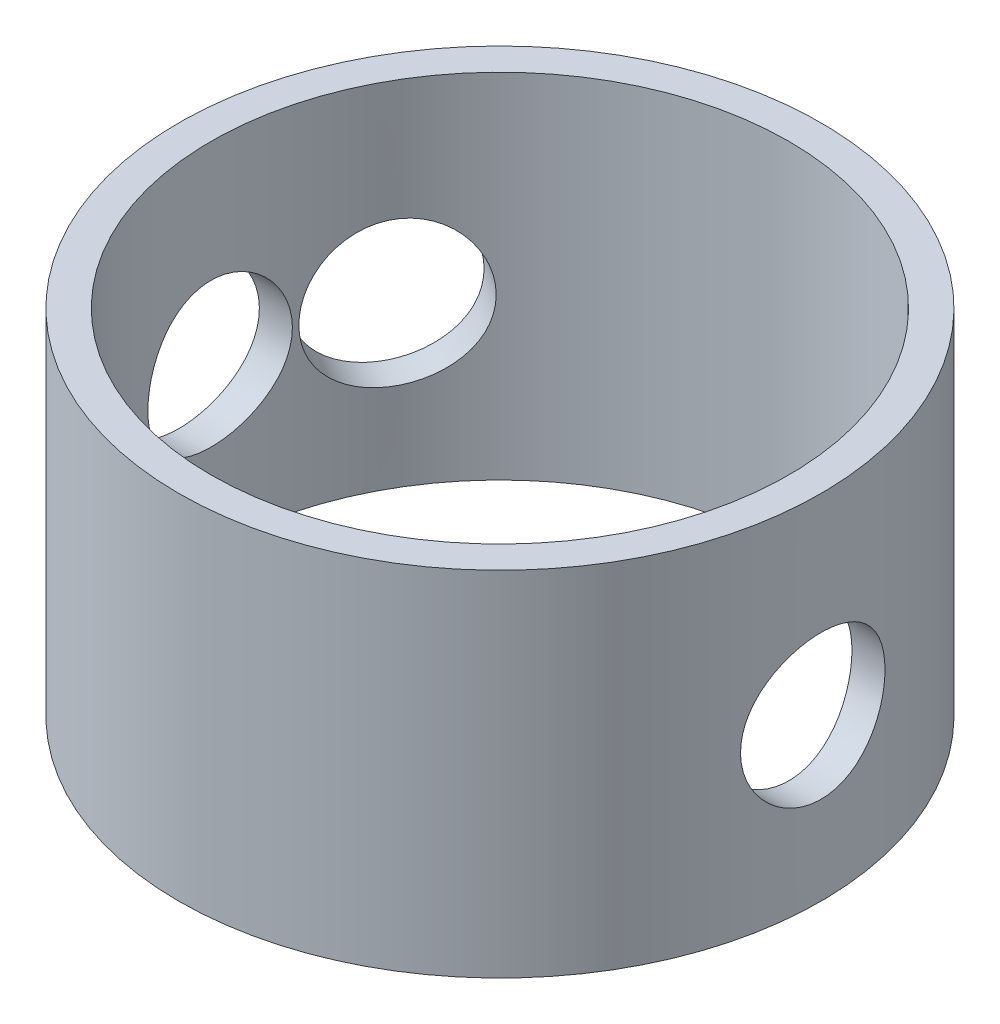
ISO-10303-21;
HEADER;
FILE_DESCRIPTION(('STEP AP214'),'2;1');
FILE_NAME('part.step','',(''),(''),'','','');
FILE_SCHEMA(('AUTOMOTIVE_DESIGN { 1 0 10303 214 1 1 1 1 }'));
ENDSEC;
DATA;
#1=APPLICATION_CONTEXT('core data for automotive mechanical design processes');
#2=APPLICATION_PROTOCOL_DEFINITION('international standard','automotive_design',2000,#1);
#3=PRODUCT_CONTEXT('',#1,'mechanical');
#4=PRODUCT('Part','Part','',(#3));
#5=PRODUCT_RELATED_PRODUCT_CATEGORY('part','',(#4));
#6=PRODUCT_DEFINITION_FORMATION('','',#4);
#7=PRODUCT_DEFINITION_CONTEXT('part definition',#1,'design');
#8=PRODUCT_DEFINITION('design','',#6,#7);
#9=PRODUCT_DEFINITION_SHAPE('','',#8);
#10=(LENGTH_UNIT() NAMED_UNIT(*) SI_UNIT(.MILLI.,.METRE.));
#11=(NAMED_UNIT(*) PLANE_ANGLE_UNIT() SI_UNIT($,.RADIAN.));
#12=(NAMED_UNIT(*) SI_UNIT($,.STERADIAN.) SOLID_ANGLE_UNIT());
#13=UNCERTAINTY_MEASURE_WITH_UNIT(LENGTH_MEASURE(1.E-05),#10,'distance_accuracy_value','');
#14=(GEOMETRIC_REPRESENTATION_CONTEXT(3) GLOBAL_UNCERTAINTY_ASSIGNED_CONTEXT((#13)) GLOBAL_UNIT_ASSIGNED_CONTEXT((#10,
#11,#12)) REPRESENTATION_CONTEXT('',''));
#15=CARTESIAN_POINT('',(0.,0.,0.));
#16=DIRECTION('',(0.,0.,1.));
#17=DIRECTION('',(1.,0.,0.));
#18=AXIS2_PLACEMENT_3D('',#15,#16,#17);
#19=CARTESIAN_POINT('',(0.,-5.,0.));
#20=DIRECTION('',(0.,1.,0.));
#21=DIRECTION('',(0.,0.,1.));
#22=AXIS2_PLACEMENT_3D('',#19,#20,#21);
#23=CYLINDRICAL_SURFACE('',#22,10.);
#24=CARTESIAN_POINT('',(-10.,2.25,0.));
#25=CARTESIAN_POINT('',(-9.99999771694518,2.24999587078108,-0.124699980173304));
#26=CARTESIAN_POINT('',(-9.99764387141181,2.2395982953768,-0.249449090211301));
#27=CARTESIAN_POINT('',(-9.9884813966466,2.19832951041739,-0.495397749746435));
#28=CARTESIAN_POINT('',(-9.9816697099651,2.16744424900414,-0.616594803385697));
#29=CARTESIAN_POINT('',(-9.96434919694451,2.08622125907406,-0.851849872654528));
#30=CARTESIAN_POINT('',(-9.95384434542968,2.0359044383554,-0.965915408843231));
#31=CARTESIAN_POINT('',(-9.93026839001207,1.91731441158288,-1.18398243160764));
#32=CARTESIAN_POINT('',(-9.91719732262225,1.84904146101007,-1.28798406134451));
#33=CARTESIAN_POINT('',(-9.88967110046879,1.69525502679128,-1.48473408395884));
#34=CARTESIAN_POINT('',(-9.87519795610526,1.60949570009561,-1.57728781649952));
#35=CARTESIAN_POINT('',(-9.8466241340422,1.42369841608187,-1.74682611866484));
#36=CARTESIAN_POINT('',(-9.83252349122492,1.32365912711958,-1.82380923466833));
#37=CARTESIAN_POINT('',(-9.80611312139272,1.1106886380241,-1.96089062994942));
#38=CARTESIAN_POINT('',(-9.79382640798822,0.997619652513677,-2.0207796762197));
#39=CARTESIAN_POINT('',(-9.77269409851722,0.762699838887984,-2.12063014285829));
#40=CARTESIAN_POINT('',(-9.7638480651916,0.640850129006192,-2.16059409559087));
#41=CARTESIAN_POINT('',(-9.75078225790901,0.393945077725128,-2.2188126339931));
#42=CARTESIAN_POINT('',(-9.74648890346122,0.268975229377931,-2.237412923577));
#43=CARTESIAN_POINT('',(-9.74279372340889,0.0176207324970899,-2.25345144263654));
#44=CARTESIAN_POINT('',(-9.74339126020144,-0.108763729474717,-2.25089243055212));
#45=CARTESIAN_POINT('',(-9.7493438221449,-0.35677500839379,-2.22496273321229));
#46=CARTESIAN_POINT('',(-9.75460659824395,-0.478446565475752,-2.20199557166843));
#47=CARTESIAN_POINT('',(-9.76915058701734,-0.716164082748739,-2.13654167024627));
#48=CARTESIAN_POINT('',(-9.77843203686247,-0.832209710463741,-2.0940537783005));
#49=CARTESIAN_POINT('',(-9.80005729379312,-1.05650562440403,-1.99039912002163));
#50=CARTESIAN_POINT('',(-9.8124261019186,-1.16468246903344,-1.92907886854504));
#51=CARTESIAN_POINT('',(-9.83881732813755,-1.36935943001856,-1.78960795010145));
#52=CARTESIAN_POINT('',(-9.85283998387547,-1.46585786423543,-1.71145486305659));
#53=CARTESIAN_POINT('',(-9.88135331942439,-1.64676002262606,-1.53840941447694));
#54=CARTESIAN_POINT('',(-9.89584735926513,-1.73083578516287,-1.44317439868844));
#55=CARTESIAN_POINT('',(-9.92337817561626,-1.88187798698242,-1.23979023032877));
#56=CARTESIAN_POINT('',(-9.93641492265959,-1.94884408033572,-1.13164081671453));
#57=CARTESIAN_POINT('',(-9.9596085297879,-2.06385442564537,-0.905084686036906));
#58=CARTESIAN_POINT('',(-9.96975853624758,-2.11185375057136,-0.786654415509773));
#59=CARTESIAN_POINT('',(-9.98598436481004,-2.18717808536306,-0.543129505070469));
#60=CARTESIAN_POINT('',(-9.99206081464266,-2.21450628070668,-0.418035895178883));
#61=CARTESIAN_POINT('',(-9.99936485032445,-2.24723107008369,-0.167546638635216));
#62=CARTESIAN_POINT('',(-10.0006914083681,-2.25307538769192,-0.0422122904927544));
#63=CARTESIAN_POINT('',(-9.998624405112,-2.24388280727281,0.207642012862522));
#64=CARTESIAN_POINT('',(-9.99523118361733,-2.22884741250097,0.332162026055726));
#65=CARTESIAN_POINT('',(-9.98416853819685,-2.17869311915451,0.575355741580678));
#66=CARTESIAN_POINT('',(-9.97654952458062,-2.14381085342044,0.694080742417265));
#67=CARTESIAN_POINT('',(-9.95788891115751,-2.05521709888024,0.9239935007677));
#68=CARTESIAN_POINT('',(-9.94684700837049,-2.00150394318563,1.03518058999426));
#69=CARTESIAN_POINT('',(-9.92232244804704,-1.87585280628475,1.24869945121971));
#70=CARTESIAN_POINT('',(-9.90880573869581,-1.80365412939586,1.35087381002615));
#71=CARTESIAN_POINT('',(-9.8808971094203,-1.64342272060557,1.5418171847585));
#72=CARTESIAN_POINT('',(-9.86650506892447,-1.55538780407373,1.63058434803184));
#73=CARTESIAN_POINT('',(-9.83812317322868,-1.36392321097715,1.79397825629388));
#74=CARTESIAN_POINT('',(-9.82414670937266,-1.26022586804994,1.86829411913197));
#75=CARTESIAN_POINT('',(-9.79849887314339,-1.04156031811999,1.99845908651711));
#76=CARTESIAN_POINT('',(-9.78682739936824,-0.926592607260111,2.05430900349706));
#77=CARTESIAN_POINT('',(-9.76722644872885,-0.689273282785766,2.1455693288797));
#78=CARTESIAN_POINT('',(-9.75927557489345,-0.566968571315208,2.1810968796756));
#79=CARTESIAN_POINT('',(-9.74798028769131,-0.317921950371438,2.23104191763122));
#80=CARTESIAN_POINT('',(-9.74463508800211,-0.191180802116749,2.24546300830367));
#81=CARTESIAN_POINT('',(-9.74298148577602,0.0600013089167236,2.25262552273881));
#82=CARTESIAN_POINT('',(-9.74455840453851,0.184427692756016,2.24586054101785));
#83=CARTESIAN_POINT('',(-9.75231090038413,0.430318309827299,2.2119514057036));
#84=CARTESIAN_POINT('',(-9.75848641660509,0.551782582240692,2.18480752182386));
#85=CARTESIAN_POINT('',(-9.77468279684128,0.787881404344379,2.11115577035663));
#86=CARTESIAN_POINT('',(-9.78468859473724,0.902540705210114,2.06472371114527));
#87=CARTESIAN_POINT('',(-9.80742322558036,1.12251375516475,1.95387734313721));
#88=CARTESIAN_POINT('',(-9.82015236098498,1.22782646436923,1.88946103674367));
#89=CARTESIAN_POINT('',(-9.8472390229921,1.4285411498367,1.74285474963165));
#90=CARTESIAN_POINT('',(-9.86162550918978,1.52368358555722,1.66031472333599));
#91=CARTESIAN_POINT('',(-9.89021568200379,1.69892877873713,1.48050834559761));
#92=CARTESIAN_POINT('',(-9.90441932543721,1.77902804194522,1.38323858216312));
#93=CARTESIAN_POINT('',(-9.93127801911181,1.92298363561255,1.17510318835927));
#94=CARTESIAN_POINT('',(-9.94390879221351,1.9865986429252,1.06406732741539));
#95=CARTESIAN_POINT('',(-9.96595299275023,2.0941606300921,0.832614984311326));
#96=CARTESIAN_POINT('',(-9.97536904379473,2.13812365749292,0.712206250610561));
#97=CARTESIAN_POINT('',(-9.98829672089429,2.19754384373666,0.493113147452931));
#98=CARTESIAN_POINT('',(-9.99265771842981,2.21717645823927,0.395589687899849));
#99=CARTESIAN_POINT('',(-9.99851019685605,2.24340585990937,0.198721159324828));
#100=CARTESIAN_POINT('',(-10.000001819417,2.25000329066616,0.0993761804816512));
#101=CARTESIAN_POINT('',(-10.,2.25,0.));
#102=B_SPLINE_CURVE_WITH_KNOTS('',3,(#24,#25,#26,#27,#28,#29,#30,#31,#32,#33,#34,#35,#36,#37,
#38,#39,#40,#41,#42,#43,#44,#45,#46,#47,#48,#49,#50,#51,#52,#53,#54,#55,#56,#57,#58,#59,#60,#61,
#62,#63,#64,#65,#66,#67,#68,#69,#70,#71,#72,#73,#74,#75,#76,#77,#78,#79,#80,#81,#82,#83,#84,#85,
#86,#87,#88,#89,#90,#91,#92,#93,#94,#95,#96,#97,#98,#99,#100,#101),.UNSPECIFIED.,.T.,.F.,(4,2,2,
2,2,2,2,2,2,2,2,2,2,2,2,2,2,2,2,2,2,2,2,2,2,2,2,2,2,2,2,2,2,2,2,2,2,2,4),(0.,0.373736106234698,
0.747728811688385,1.12132022791483,1.49490632894446,1.87416011882319,2.2534492982533,
2.63719933934683,3.02090059558661,3.39830126943979,3.77565274409459,4.14570499983861,
4.51577909800026,4.88895317842802,5.26218094641699,5.64396439872406,6.02575556945528,
6.40844575317233,6.79107695125827,7.16568740644777,7.54027089258629,7.91047912717914,
8.28072014045199,8.65650159427476,9.03233492746191,9.41552668316496,9.79870157761228,
10.1796449182611,10.5605232127409,10.9325943469771,11.304660556961,11.6752780659135,
12.0459367575248,12.4245075326659,12.8031661343442,13.1870895339321,13.5706988514769,
13.8685521516599,14.1663907454919),.UNSPECIFIED.);
#103=CARTESIAN_POINT('',(-10.,2.25,0.));
#104=VERTEX_POINT('',#103);
#105=EDGE_CURVE('E75',#104,#104,#102,.T.);
#106=ORIENTED_EDGE('',*,*,#105,.F.);
#107=EDGE_LOOP('',(#106));
#108=FACE_BOUND('',#107,.T.);
#109=CARTESIAN_POINT('',(9.74358763495254,0.,-2.25));
#110=CARTESIAN_POINT('',(9.74359014970083,0.12465493713428,-2.24999583947943));
#111=CARTESIAN_POINT('',(9.74600587019631,0.249359079583871,-2.23960551864261));
#112=CARTESIAN_POINT('',(9.75538868577708,0.495214406159011,-2.19836815743239));
#113=CARTESIAN_POINT('',(9.76235894789331,0.616363056652703,-2.16750688221769));
#114=CARTESIAN_POINT('',(9.78002237082416,0.851515548645589,-2.08635400208704));
#115=CARTESIAN_POINT('',(9.79071130914383,0.965527321432348,-2.03608442789582));
#116=CARTESIAN_POINT('',(9.81460259962033,1.18350349700749,-1.91760581557624));
#117=CARTESIAN_POINT('',(9.82780493079433,1.2874679836638,-1.84939692721082));
#118=CARTESIAN_POINT('',(9.85549903665696,1.48425674436178,-1.69567654866098));
#119=CARTESIAN_POINT('',(9.87000811245196,1.57687532789459,-1.60990480915542));
#120=CARTESIAN_POINT('',(9.89852970621588,1.74653970570839,-1.42405506445542));
#121=CARTESIAN_POINT('',(9.91254218410064,1.82358424524172,-1.32397590766918));
#122=CARTESIAN_POINT('',(9.93868076229402,1.96073251599313,-1.1109673245557));
#123=CARTESIAN_POINT('',(9.950784065854,2.02063759577535,-0.997906955654935));
#124=CARTESIAN_POINT('',(9.97154477868448,2.12052004223792,-0.763005710649612));
#125=CARTESIAN_POINT('',(9.98020259753511,2.16049977767543,-0.641165880233716));
#126=CARTESIAN_POINT('',(9.99297457003381,2.21874744169933,-0.394304193441953));
#127=CARTESIAN_POINT('',(9.99716154621383,2.23736373228074,-0.269368365510213));
#128=CARTESIAN_POINT('',(10.000772662194,2.25344606136175,-0.0180814531885601));
#129=CARTESIAN_POINT('',(10.0001973772397,2.25091465434498,0.108269458428569));
#130=CARTESIAN_POINT('',(9.99440416997914,2.22503120587374,0.356395632291741));
#131=CARTESIAN_POINT('',(9.98927000035897,2.20205475073033,0.478212318524264));
#132=CARTESIAN_POINT('',(9.9750317145991,2.13653291848458,0.716215174786588));
#133=CARTESIAN_POINT('',(9.96592741226151,2.09398662355818,0.832401080450657));
#134=CARTESIAN_POINT('',(9.94463838196142,1.99020610273303,1.05687674309831));
#135=CARTESIAN_POINT('',(9.93243058557695,1.92883118346861,1.16509917671437));
#136=CARTESIAN_POINT('',(9.90627047285625,1.78924085447851,1.3698446731545));
#137=CARTESIAN_POINT('',(9.89231790615101,1.71102302668352,1.46636605299174));
#138=CARTESIAN_POINT('',(9.86383762387237,1.53792819802948,1.64720476904414));
#139=CARTESIAN_POINT('',(9.84930400812898,1.44272253138736,1.73120687331084));
#140=CARTESIAN_POINT('',(9.82158596720638,1.23942444705809,1.88211397959163));
#141=CARTESIAN_POINT('',(9.80840158304563,1.13133163780054,1.94901846190742));
#142=CARTESIAN_POINT('',(9.78485802013293,0.904797503492762,2.06398269316304));
#143=CARTESIAN_POINT('',(9.77450826729007,0.786323340642461,2.11197979640573));
#144=CARTESIAN_POINT('',(9.75793419845763,0.542702107619626,2.18728657822245));
#145=CARTESIAN_POINT('',(9.75170918571296,0.417556168310907,2.21459975085748));
#146=CARTESIAN_POINT('',(9.74423235024912,0.167032460047606,2.24726797888054));
#147=CARTESIAN_POINT('',(9.74287628318979,0.0417177608843139,2.25308338399437));
#148=CARTESIAN_POINT('',(9.74500918390387,-0.208090589776521,2.24384001785704));
#149=CARTESIAN_POINT('',(9.74849779782318,-0.332584300571535,2.22878277113847));
#150=CARTESIAN_POINT('',(9.75982825885123,-0.575593823199035,2.17862178112616));
#151=CARTESIAN_POINT('',(9.76761441853196,-0.69416537233223,2.14377431501384));
#152=CARTESIAN_POINT('',(9.78661192924552,-0.923786432944827,2.0553008160828));
#153=CARTESIAN_POINT('',(9.7978236236396,-1.03483518900707,2.00167290071165));
#154=CARTESIAN_POINT('',(9.82263613266839,-1.24824266005728,1.87615632667619));
#155=CARTESIAN_POINT('',(9.83627273871581,-1.35043127036218,1.80398567288353));
#156=CARTESIAN_POINT('',(9.86430547065202,-1.54141619858605,1.64379886466324));
#157=CARTESIAN_POINT('',(9.878701696453,-1.63021074883814,1.55578062212344));
#158=CARTESIAN_POINT('',(9.90697705878081,-1.7936886208323,1.36430826037001));
#159=CARTESIAN_POINT('',(9.92084027992924,-1.86805719245284,1.26058265370263));
#160=CARTESIAN_POINT('',(9.94618846175428,-1.99831462326587,1.04184410580638));
#161=CARTESIAN_POINT('',(9.95767353676427,-2.05420437093602,0.92683170760102));
#162=CARTESIAN_POINT('',(9.97690459087043,-2.14548669792765,0.689520876825789));
#163=CARTESIAN_POINT('',(9.9846749498056,-2.18101323714257,0.567276038448168));
#164=CARTESIAN_POINT('',(9.99570675097453,-2.23097643923395,0.318357687912381));
#165=CARTESIAN_POINT('',(9.99896888897544,-2.24541635649103,0.191684862233335));
#166=CARTESIAN_POINT('',(10.0005945519274,-2.25264299938778,-0.0595119029764088));
#167=CARTESIAN_POINT('',(9.99906414456862,-2.24589856299768,-0.184021896799827));
#168=CARTESIAN_POINT('',(9.99150544104513,-2.21200143103687,-0.430085295156806));
#169=CARTESIAN_POINT('',(9.98547723506242,-2.18484914464882,-0.551638758919112));
#170=CARTESIAN_POINT('',(9.96960979622924,-2.11113718163774,-0.787951349552583));
#171=CARTESIAN_POINT('',(9.95978432500258,-2.06464753941443,-0.902733305103031));
#172=CARTESIAN_POINT('',(9.93736861400647,-1.95364750601892,-1.12292829761308));
#173=CARTESIAN_POINT('',(9.92477808936174,-1.8891352578444,-1.22834036764797));
#174=CARTESIAN_POINT('',(9.89788896627624,-1.74241134280584,-1.42907855307012));
#175=CARTESIAN_POINT('',(9.88356129144448,-1.65987210581908,-1.5241613644906));
#176=CARTESIAN_POINT('',(9.85496405606879,-1.48009332171485,-1.69928665198815));
#177=CARTESIAN_POINT('',(9.84069451049126,-1.38285020761072,-1.77932546797319));
#178=CARTESIAN_POINT('',(9.81360024796413,-1.17474714285077,-1.92320057007167));
#179=CARTESIAN_POINT('',(9.80079917162417,-1.06371199676088,-1.98678817838449));
#180=CARTESIAN_POINT('',(9.77839198535867,-0.832264384714451,-2.09429912739728));
#181=CARTESIAN_POINT('',(9.76878324351739,-0.711859745022749,-2.13823867730363));
#182=CARTESIAN_POINT('',(9.75557392067199,-0.492825536248246,-2.19760544250056));
#183=CARTESIAN_POINT('',(9.75110962550751,-0.395360045797478,-2.21721478432225));
#184=CARTESIAN_POINT('',(9.74511556096745,-0.198606715730868,-2.24341336497733));
#185=CARTESIAN_POINT('',(9.74358563132372,-0.0993189759410581,-2.25000331489993));
#186=CARTESIAN_POINT('',(9.74358763495254,0.,-2.25));
#187=B_SPLINE_CURVE_WITH_KNOTS('',3,(#109,#110,#111,#112,#113,#114,#115,#116,#117,#118,#119,
#120,#121,#122,#123,#124,#125,#126,#127,#128,#129,#130,#131,#132,#133,#134,#135,#136,#137,#138,
#139,#140,#141,#142,#143,#144,#145,#146,#147,#148,#149,#150,#151,#152,#153,#154,#155,#156,#157,
#158,#159,#160,#161,#162,#163,#164,#165,#166,#167,#168,#169,#170,#171,#172,#173,#174,#175,#176,
#177,#178,#179,#180,#181,#182,#183,#184,#185,#186),.UNSPECIFIED.,.T.,.F.,(4,2,2,2,2,2,2,2,2,2,2,
2,2,2,2,2,2,2,2,2,2,2,2,2,2,2,2,2,2,2,2,2,2,2,2,2,2,2,4),(0.,0.37360068321205,0.747461429010009,
1.12089904026706,1.49433353405061,1.87376445216186,2.25322592755654,2.63692212096272,
3.02057268905775,3.39787417630111,3.77513008900697,4.14559549062183,4.51607826880895,
4.88939977173563,5.26277490672007,5.64436489931667,6.02596648932099,6.40882201190648,
6.7916128456685,7.1661575467213,7.54067489257641,7.91044946967034,8.28026112358674,
8.65606921440563,9.03192685878778,9.41523792815891,9.7985305649247,10.1792718741986,
10.5599544159687,10.9322717825488,11.3045816842686,11.6755547669031,12.0465660877438,
12.4249825862442,12.8034910318269,13.1874247243883,13.571041093279,13.8687241607271,
14.1663909689621),.UNSPECIFIED.);
#188=CARTESIAN_POINT('',(9.74358763495254,0.,-2.25));
#189=VERTEX_POINT('',#188);
#190=EDGE_CURVE('E71',#189,#189,#187,.T.);
#191=ORIENTED_EDGE('',*,*,#190,.F.);
#192=EDGE_LOOP('',(#191));
#193=FACE_BOUND('',#192,.T.);
#194=CARTESIAN_POINT('',(-9.56319441586885,0.,-2.92323665896122));
#195=CARTESIAN_POINT('',(-9.56319451344447,-0.12465493713428,-2.92324151945188));
#196=CARTESIAN_POINT('',(-9.56009142834359,-0.249359079583871,-2.93344766149778));
#197=CARTESIAN_POINT('',(-9.54759850439045,-0.49521440615901,-2.97385167168125));
#198=CARTESIAN_POINT('',(-9.5382042908468,-0.616363056652702,-3.00406345106847));
#199=CARTESIAN_POINT('',(-9.51292482375737,-0.851515548645588,-3.08317561831731));
#200=CARTESIAN_POINT('',(-9.49704692878608,-0.965527321432347,-3.13205481576417));
#201=CARTESIAN_POINT('',(-9.45849808710814,-1.18350349700749,-3.24660594907631));
#202=CARTESIAN_POINT('',(-9.43582719711129,-1.2874679836638,-3.31227774475166));
#203=CARTESIAN_POINT('',(-9.3829508070485,-1.48425674436178,-3.45925055058649));
#204=CARTESIAN_POINT('',(-9.35263016551963,-1.57687532789459,-3.54078559382259));
#205=CARTESIAN_POINT('',(-9.2844057179256,-1.74653970570839,-3.7159969909016));
#206=CARTESIAN_POINT('',(-9.24650130135065,-1.82358424524172,-3.8096743220102));
#207=CARTESIAN_POINT('',(-9.16263368252818,-1.96073251599313,-4.00721445530729));
#208=CARTESIAN_POINT('',(-9.11658526643046,-2.02063759577535,-4.11117925871658));
#209=CARTESIAN_POINT('',(-9.01711394863967,-2.12052004223792,-4.32499006068702));
#210=CARTESIAN_POINT('',(-8.96369192449773,-2.16049977767543,-4.43483535844529));
#211=CARTESIAN_POINT('',(-8.85132193374216,-2.21874744169933,-4.65500983667738));
#212=CARTESIAN_POINT('',(-8.79248004751323,-2.23736373228074,-4.76530092559912));
#213=CARTESIAN_POINT('',(-8.66996390952724,-2.25344606136175,-4.98472733329831));
#214=CARTESIAN_POINT('',(-8.60629024233387,-2.25091465434498,-5.09386279007294));
#215=CARTESIAN_POINT('',(-8.47721009074522,-2.22503120587374,-5.30584975635198));
#216=CARTESIAN_POINT('',(-8.41185542631056,-2.20205475073033,-5.4087790164241));
#217=CARTESIAN_POINT('',(-8.28052328100501,-2.13653291848458,-5.6077763932406));
#218=CARTESIAN_POINT('',(-8.21454577106488,-2.09398662355818,-5.70384418793859));
#219=CARTESIAN_POINT('',(-8.08387109867925,-1.99020610273303,-5.88760129917276));
#220=CARTESIAN_POINT('',(-8.01918762007804,-1.92883118346861,-5.97522077775141));
#221=CARTESIAN_POINT('',(-7.89415954967598,-1.78924085447851,-6.13945552261866));
#222=CARTESIAN_POINT('',(-7.83381558254262,-1.71102302668352,-6.21606920621342));
#223=CARTESIAN_POINT('',(-7.71873157655618,-1.53792819802948,-6.35843998716324));
#224=CARTESIAN_POINT('',(-7.66414404398021,-1.44272253138736,-6.42392113555786));
#225=CARTESIAN_POINT('',(-7.5646859632577,-1.23942444705809,-6.54075150274733));
#226=CARTESIAN_POINT('',(-7.51981571048335,-1.13133163780054,-6.59210029197947));
#227=CARTESIAN_POINT('',(-7.44194427127754,-0.904797503492761,-6.67989045531704));
#228=CARTESIAN_POINT('',(-7.40898257077139,-0.78632334064246,-6.71628228961184));
#229=CARTESIAN_POINT('',(-7.35697561521007,-0.542702107619626,-6.77321284132615));
#230=CARTESIAN_POINT('',(-7.33792800971679,-0.417556168310907,-6.7937542363137));
#231=CARTESIAN_POINT('',(-7.31511876625366,-0.167032460047607,-6.81830733394637));
#232=CARTESIAN_POINT('',(-7.31103667517413,-0.0417177608843148,-6.82266558897858));
#233=CARTESIAN_POINT('',(-7.31750550444493,0.20809058977652,-6.81572704944421));
#234=CARTESIAN_POINT('',(-7.32805535608233,0.332584300571535,-6.80443139823454));
#235=CARTESIAN_POINT('',(-7.36294831817537,0.575593823199035,-6.76665593711893));
#236=CARTESIAN_POINT('',(-7.38711506331297,0.694165372332231,-6.7403702260485));
#237=CARTESIAN_POINT('',(-7.44780413966509,0.923786432944827,-6.67324868376931));
#238=CARTESIAN_POINT('',(-7.48432770951541,1.03483518900707,-6.63241139390293));
#239=CARTESIAN_POINT('',(-7.56857425968371,1.24824266005728,-6.53611710670663));
#240=CARTESIAN_POINT('',(-7.6164692338385,1.35043127036218,-6.48043379013816));
#241=CARTESIAN_POINT('',(-7.72083969594287,1.54141619858605,-6.35572431083635));
#242=CARTESIAN_POINT('',(-7.77731631447505,1.63021074883814,-6.28669638970091));
#243=CARTESIAN_POINT('',(-7.89753967742885,1.7936886208323,-6.13501414146374));
#244=CARTESIAN_POINT('',(-7.96140838245536,1.86805719245284,-6.05211674164105));
#245=CARTESIAN_POINT('',(-8.09272982580372,1.99831462326587,-5.8753576932885));
#246=CARTESIAN_POINT('',(-8.16018239162942,2.05420437093602,-5.78149657219748));
#247=CARTESIAN_POINT('',(-8.29549238841452,2.14548669792765,-5.58559489120602));
#248=CARTESIAN_POINT('',(-8.36334413583771,2.18101323714257,-5.48361293515706));
#249=CARTESIAN_POINT('',(-8.49735713116739,2.23097643923395,-5.27355922070941));
#250=CARTESIAN_POINT('',(-8.56351863838636,2.24541635649103,-5.16548840470266));
#251=CARTESIAN_POINT('',(-8.69052488640557,2.25264299938778,-4.9487584561585));
#252=CARTESIAN_POINT('',(-8.75145451166648,2.24589856299769,-4.84016443480301));
#253=CARTESIAN_POINT('',(-8.86794018157395,2.21200143103687,-4.62328792912259));
#254=CARTESIAN_POINT('',(-8.92349633393483,2.18484914464882,-4.51500543859508));
#255=CARTESIAN_POINT('',(-9.02791102412904,2.11113718163775,-4.3024190124558));
#256=CARTESIAN_POINT('',(-9.07679289421782,2.06464753941443,-4.19810218743972));
#257=CARTESIAN_POINT('',(-9.16747781530633,1.95364750601892,-3.99619987464184));
#258=CARTESIAN_POINT('',(-9.20928013613446,1.8891352578444,-3.89861508180375));
#259=CARTESIAN_POINT('',(-9.28636256516801,1.74241134280584,-3.71132615217583));
#260=CARTESIAN_POINT('',(-9.32149584049677,1.65987210581907,-3.62181818460657));
#261=CARTESIAN_POINT('',(-9.38429255193219,1.48009332171485,-3.45585661910079));
#262=CARTESIAN_POINT('',(-9.41195417095412,1.38285020761072,-3.37940619838016));
#263=CARTESIAN_POINT('',(-9.46042740235806,1.17474714285078,-3.24125957372722));
#264=CARTESIAN_POINT('',(-9.48113514920828,1.06371199676088,-3.17979055139245));
#265=CARTESIAN_POINT('',(-9.51548543118142,0.832264384714452,-3.07547974522965));
#266=CARTESIAN_POINT('',(-9.52913379160164,0.711859745022751,-3.03262260785926));
#267=CARTESIAN_POINT('',(-9.5473775650492,0.492825536248246,-2.97460481963551));
#268=CARTESIAN_POINT('',(-9.55331604293761,0.395360045797477,-2.95539048388419));
#269=CARTESIAN_POINT('',(-9.56122432110153,0.198606715730867,-2.92970481522376));
#270=CARTESIAN_POINT('',(-9.56319433812536,0.0993189759410577,-2.92323278635926));
#271=CARTESIAN_POINT('',(-9.56319441586885,0.,-2.92323665896122));
#272=B_SPLINE_CURVE_WITH_KNOTS('',3,(#194,#195,#196,#197,#198,#199,#200,#201,#202,#203,#204,
#205,#206,#207,#208,#209,#210,#211,#212,#213,#214,#215,#216,#217,#218,#219,#220,#221,#222,#223,
#224,#225,#226,#227,#228,#229,#230,#231,#232,#233,#234,#235,#236,#237,#238,#239,#240,#241,#242,
#243,#244,#245,#246,#247,#248,#249,#250,#251,#252,#253,#254,#255,#256,#257,#258,#259,#260,#261,
#262,#263,#264,#265,#266,#267,#268,#269,#270,#271),.UNSPECIFIED.,.T.,.F.,(4,2,2,2,2,2,2,2,2,2,2,
2,2,2,2,2,2,2,2,2,2,2,2,2,2,2,2,2,2,2,2,2,2,2,2,2,2,2,4),(0.,0.37360068321205,0.747461429010008,
1.12089904026706,1.49433353405061,1.87376445216185,2.25322592755653,2.63692212096272,
3.02057268905775,3.39787417630111,3.77513008900697,4.14559549062183,4.51607826880895,
4.88939977173563,5.26277490672007,5.64436489931667,6.02596648932099,6.40882201190648,
6.79161284566849,7.1661575467213,7.54067489257641,7.91044946967034,8.28026112358674,
8.65606921440563,9.03192685878778,9.41523792815891,9.7985305649247,10.1792718741986,
10.5599544159687,10.9322717825488,11.3045816842686,11.6755547669031,12.0465660877438,
12.4249825862442,12.8034910318269,13.1874247243883,13.571041093279,13.8687241607271,
14.1663909689621),.UNSPECIFIED.);
#273=CARTESIAN_POINT('',(-9.56319441586885,0.,-2.92323665896122));
#274=VERTEX_POINT('',#273);
#275=EDGE_CURVE('E85',#274,#274,#272,.T.);
#276=ORIENTED_EDGE('',*,*,#275,.T.);
#277=EDGE_LOOP('',(#276));
#278=FACE_BOUND('',#277,.T.);
#279=CARTESIAN_POINT('',(0.,-5.,0.));
#280=DIRECTION('',(0.,1.,0.));
#281=DIRECTION('',(0.,0.,1.));
#282=AXIS2_PLACEMENT_3D('',#279,#280,#281);
#283=CIRCLE('',#282,10.);
#284=CARTESIAN_POINT('',(0.,-5.,10.));
#285=VERTEX_POINT('',#284);
#286=EDGE_CURVE('E10',#285,#285,#283,.T.);
#287=ORIENTED_EDGE('',*,*,#286,.T.);
#288=EDGE_LOOP('',(#287));
#289=FACE_BOUND('',#288,.T.);
#290=CARTESIAN_POINT('',(0.,6.,0.));
#291=DIRECTION('',(0.,1.,0.));
#292=DIRECTION('',(0.,0.,1.));
#293=AXIS2_PLACEMENT_3D('',#290,#291,#292);
#294=CIRCLE('',#293,10.);
#295=CARTESIAN_POINT('',(0.,6.,10.));
#296=VERTEX_POINT('',#295);
#297=EDGE_CURVE('E48',#296,#296,#294,.T.);
#298=ORIENTED_EDGE('',*,*,#297,.F.);
#299=EDGE_LOOP('',(#298));
#300=FACE_BOUND('',#299,.T.);
#301=ADVANCED_FACE('F31',(#108,#193,#278,#289,#300),#23,.T.);
#302=CARTESIAN_POINT('',(0.,-5.,0.));
#303=DIRECTION('',(0.,1.,0.));
#304=DIRECTION('',(0.,0.,1.));
#305=AXIS2_PLACEMENT_3D('',#302,#303,#304);
#306=PLANE('',#305);
#307=CARTESIAN_POINT('',(0.,-5.,0.));
#308=DIRECTION('',(0.,1.,0.));
#309=DIRECTION('',(0.,0.,1.));
#310=AXIS2_PLACEMENT_3D('',#307,#308,#309);
#311=CIRCLE('',#310,9.);
#312=CARTESIAN_POINT('',(0.,-5.,9.));
#313=VERTEX_POINT('',#312);
#314=EDGE_CURVE('E43',#313,#313,#311,.T.);
#315=ORIENTED_EDGE('',*,*,#314,.T.);
#316=EDGE_LOOP('',(#315));
#317=FACE_BOUND('',#316,.T.);
#318=ORIENTED_EDGE('',*,*,#286,.F.);
#319=EDGE_LOOP('',(#318));
#320=FACE_BOUND('',#319,.T.);
#321=ADVANCED_FACE('F102',(#317,#320),#306,.F.);
#322=CARTESIAN_POINT('',(0.,-5.,0.));
#323=DIRECTION('',(0.,1.,0.));
#324=DIRECTION('',(0.,0.,1.));
#325=AXIS2_PLACEMENT_3D('',#322,#323,#324);
#326=CYLINDRICAL_SURFACE('',#325,9.);
#327=CARTESIAN_POINT('',(-8.71421252896669,0.,-2.25));
#328=CARTESIAN_POINT('',(-8.71421490079074,-0.124245675833919,-2.24999647073377));
#329=CARTESIAN_POINT('',(-8.71689875413137,-0.24853040881067,-2.23967362094789));
#330=CARTESIAN_POINT('',(-8.72731675793308,-0.493530820356159,-2.19872081291741));
#331=CARTESIAN_POINT('',(-8.73505384759467,-0.614244379021367,-2.16807903606789));
#332=CARTESIAN_POINT('',(-8.75464852136535,-0.848523184368464,-2.08754207966884));
#333=CARTESIAN_POINT('',(-8.76650078421412,-0.962097439847137,-2.03767175506904));
#334=CARTESIAN_POINT('',(-8.79298372825883,-1.17927976728589,-1.92016902713525));
#335=CARTESIAN_POINT('',(-8.8076145274064,-1.2828874158722,-1.85253586970462));
#336=CARTESIAN_POINT('',(-8.83836644720062,-1.47947548073599,-1.69983758458069));
#337=CARTESIAN_POINT('',(-8.85451137860731,-1.57220424031504,-1.61445319893365));
#338=CARTESIAN_POINT('',(-8.88626587963764,-1.74218525492431,-1.4293638576906));
#339=CARTESIAN_POINT('',(-8.90187539909749,-1.81943606305957,-1.32965756476228));
#340=CARTESIAN_POINT('',(-8.93106373968524,-1.95729792086815,-1.11703068097106));
#341=CARTESIAN_POINT('',(-8.94461118660533,-2.01766174934532,-1.00394511857561));
#342=CARTESIAN_POINT('',(-8.96787730733385,-2.11842867973777,-0.768836865863486));
#343=CARTESIAN_POINT('',(-8.9775965460091,-2.15883472672396,-0.646815497212746));
#344=CARTESIAN_POINT('',(-8.99194282963362,-2.21773305112073,-0.399922882878745));
#345=CARTESIAN_POINT('',(-8.99666904459882,-2.23665267989392,-0.275159447594077));
#346=CARTESIAN_POINT('',(-9.00084234696568,-2.253382541348,-0.024145937336492));
#347=CARTESIAN_POINT('',(-9.00029021487034,-2.25119589498864,0.102103915084262));
#348=CARTESIAN_POINT('',(-8.9940428545818,-2.22608263477487,0.349542556137872));
#349=CARTESIAN_POINT('',(-8.98846202106784,-2.20361730745153,0.470781485102401));
#350=CARTESIAN_POINT('',(-8.97291752872371,-2.13932585695635,0.707711056680794));
#351=CARTESIAN_POINT('',(-8.96295363658607,-2.09749870316033,0.823401403583486));
#352=CARTESIAN_POINT('',(-8.93958758730796,-1.99529768638164,1.04716508287906));
#353=CARTESIAN_POINT('',(-8.92615517725509,-1.93475965980443,1.15516014697463));
#354=CARTESIAN_POINT('',(-8.89730913428722,-1.79697988879537,1.3596201502661));
#355=CARTESIAN_POINT('',(-8.88189515687385,-1.71973523829544,1.45608307894239));
#356=CARTESIAN_POINT('',(-8.85027342392421,-1.54826213221587,1.63749157894115));
#357=CARTESIAN_POINT('',(-8.83405547572767,-1.45363059688703,1.72205477791919));
#358=CARTESIAN_POINT('',(-8.80303539165594,-1.25136002381375,1.8741968459168));
#359=CARTESIAN_POINT('',(-8.7882333219746,-1.14372037845801,1.94177492110356));
#360=CARTESIAN_POINT('',(-8.76168447146387,-0.917738969266025,2.05827329030082));
#361=CARTESIAN_POINT('',(-8.74995285345306,-0.799347842718477,2.10710152568351));
#362=CARTESIAN_POINT('',(-8.73106776133802,-0.555673078730841,2.18404264643186));
#363=CARTESIAN_POINT('',(-8.7239133075846,-0.430390922413863,2.21215996474439));
#364=CARTESIAN_POINT('',(-8.71519820406711,-0.180036448623073,2.24624667479933));
#365=CARTESIAN_POINT('',(-8.7134948007924,-0.0550459859930781,2.25278142652721));
#366=CARTESIAN_POINT('',(-8.71548609028223,0.194239742926729,2.24506529146364));
#367=CARTESIAN_POINT('',(-8.7191802861327,0.318535072154498,2.23081631806482));
#368=CARTESIAN_POINT('',(-8.73141373786481,0.560802838453716,2.18243291754443));
#369=CARTESIAN_POINT('',(-8.73987273218278,0.678845453912279,2.14862766145371));
#370=CARTESIAN_POINT('',(-8.76060646436524,0.907588312067995,2.06245627350342));
#371=CARTESIAN_POINT('',(-8.77288165421767,1.01828768315021,2.01008794294125));
#372=CARTESIAN_POINT('',(-8.8001652338596,1.23159715008021,1.88709360114294));
#373=CARTESIAN_POINT('',(-8.8152225174652,1.33400595603868,1.81612957845208));
#374=CARTESIAN_POINT('',(-8.84625374764001,1.52566952652133,1.65838565910252));
#375=CARTESIAN_POINT('',(-8.86222784455476,1.6149221249851,1.57160316331224));
#376=CARTESIAN_POINT('',(-8.89377662728596,1.78002993831383,1.38209112221564));
#377=CARTESIAN_POINT('',(-8.90933131855692,1.85549405629392,1.27901689319608));
#378=CARTESIAN_POINT('',(-8.93787494952321,1.98804228025613,1.06133103606302));
#379=CARTESIAN_POINT('',(-8.95086402303554,2.04512734494739,0.946720010154579));
#380=CARTESIAN_POINT('',(-8.97273104164492,2.13880143107514,0.710005953894953));
#381=CARTESIAN_POINT('',(-8.98163847020168,2.17553785594116,0.587964107312734));
#382=CARTESIAN_POINT('',(-8.9944676405621,2.22791430114757,0.339186960717315));
#383=CARTESIAN_POINT('',(-8.99839034454079,2.24355839286514,0.21245257134279));
#384=CARTESIAN_POINT('',(-9.00076881169814,2.25307707654496,-0.0384379344974771));
#385=CARTESIAN_POINT('',(-8.99936952479974,2.24752884546467,-0.162571110673549));
#386=CARTESIAN_POINT('',(-8.99158267029247,2.21614238858771,-0.408076866933189));
#387=CARTESIAN_POINT('',(-8.9851952510363,2.19030476622037,-0.52944952900709));
#388=CARTESIAN_POINT('',(-8.9681722392125,2.11938250551556,-0.765384830200742));
#389=CARTESIAN_POINT('',(-8.95755970130383,2.07440223004265,-0.879980612806942));
#390=CARTESIAN_POINT('',(-8.9332040005573,1.96656619720596,-1.10006336934365));
#391=CARTESIAN_POINT('',(-8.91946044312204,1.90370818649141,-1.20554919284767));
#392=CARTESIAN_POINT('',(-8.88991311780646,1.7601407235087,-1.40715433895243));
#393=CARTESIAN_POINT('',(-8.87406788118745,1.67903967846638,-1.50298872367126));
#394=CARTESIAN_POINT('',(-8.84228960378677,1.50204858305097,-1.67988379561538));
#395=CARTESIAN_POINT('',(-8.8263565417643,1.40615478874988,-1.76094073142233));
#396=CARTESIAN_POINT('',(-8.7958682065238,1.20014681807371,-1.90746455956162));
#397=CARTESIAN_POINT('',(-8.781344182649,1.08980072242818,-1.97261239368685));
#398=CARTESIAN_POINT('',(-8.75573899863363,0.859375147781657,-2.08333551731731));
#399=CARTESIAN_POINT('',(-8.74465533524731,0.739302826288845,-2.12892504694234));
#400=CARTESIAN_POINT('',(-8.72891794689159,0.516201723370889,-2.19245068928476));
#401=CARTESIAN_POINT('',(-8.72344491757872,0.414240380131192,-2.21398463384298));
#402=CARTESIAN_POINT('',(-8.71609136810895,0.208195044755202,-2.24276015828648));
#403=CARTESIAN_POINT('',(-8.71421054150492,0.104111234450095,-2.25000295733644));
#404=CARTESIAN_POINT('',(-8.71421252896669,0.,-2.25));
#405=B_SPLINE_CURVE_WITH_KNOTS('',3,(#327,#328,#329,#330,#331,#332,#333,#334,#335,#336,#337,
#338,#339,#340,#341,#342,#343,#344,#345,#346,#347,#348,#349,#350,#351,#352,#353,#354,#355,#356,
#357,#358,#359,#360,#361,#362,#363,#364,#365,#366,#367,#368,#369,#370,#371,#372,#373,#374,#375,
#376,#377,#378,#379,#380,#381,#382,#383,#384,#385,#386,#387,#388,#389,#390,#391,#392,#393,#394,
#395,#396,#397,#398,#399,#400,#401,#402,#403,#404),.UNSPECIFIED.,.T.,.F.,(4,2,2,2,2,2,2,2,2,2,2,
2,2,2,2,2,2,2,2,2,2,2,2,2,2,2,2,2,2,2,2,2,2,2,2,2,2,2,4),(0.,0.372354697562523,0.7449261672858,
1.11701765444942,1.48912494079931,1.86861558773679,2.2481416933188,2.63296346758128,
3.01772843862383,3.39469875895812,3.77161333799418,4.14016436420052,4.50873501052307,
4.88063586829,5.25260146922022,5.6346341991472,6.01668478079822,6.40058788807562,
6.78440880116593,7.15809217287784,7.53174114469872,7.89927664512737,8.26685569283726,
8.64164561277692,9.0164971700099,9.40072797873237,9.78493874152048,10.1663286553069,
10.5476449402258,10.9186510151916,11.2896460564373,11.6586438890819,12.0276882516872,
12.4055738692831,12.7835552841341,13.1685882956202,13.5533404923751,13.8653804446715,
14.1773937759712),.UNSPECIFIED.);
#406=CARTESIAN_POINT('',(-8.71421252896669,0.,-2.25));
#407=VERTEX_POINT('',#406);
#408=EDGE_CURVE('E35',#407,#407,#405,.T.);
#409=ORIENTED_EDGE('',*,*,#408,.T.);
#410=EDGE_LOOP('',(#409));
#411=FACE_BOUND('',#410,.T.);
#412=CARTESIAN_POINT('',(8.71421252896669,0.,-2.25));
#413=CARTESIAN_POINT('',(8.71421490079074,0.124245675833919,-2.24999647073377));
#414=CARTESIAN_POINT('',(8.71689875413137,0.24853040881067,-2.23967362094789));
#415=CARTESIAN_POINT('',(8.72731675793308,0.493530820356159,-2.19872081291741));
#416=CARTESIAN_POINT('',(8.73505384759467,0.614244379021367,-2.16807903606789));
#417=CARTESIAN_POINT('',(8.75464852136535,0.848523184368464,-2.08754207966884));
#418=CARTESIAN_POINT('',(8.76650078421412,0.962097439847137,-2.03767175506904));
#419=CARTESIAN_POINT('',(8.79298372825883,1.17927976728589,-1.92016902713525));
#420=CARTESIAN_POINT('',(8.8076145274064,1.2828874158722,-1.85253586970462));
#421=CARTESIAN_POINT('',(8.83836644720062,1.47947548073599,-1.69983758458069));
#422=CARTESIAN_POINT('',(8.85451137860731,1.57220424031504,-1.61445319893365));
#423=CARTESIAN_POINT('',(8.88626587963764,1.74218525492431,-1.4293638576906));
#424=CARTESIAN_POINT('',(8.90187539909749,1.81943606305957,-1.32965756476228));
#425=CARTESIAN_POINT('',(8.93106373968524,1.95729792086815,-1.11703068097106));
#426=CARTESIAN_POINT('',(8.94461118660533,2.01766174934532,-1.00394511857561));
#427=CARTESIAN_POINT('',(8.96787730733385,2.11842867973777,-0.768836865863486));
#428=CARTESIAN_POINT('',(8.9775965460091,2.15883472672396,-0.646815497212746));
#429=CARTESIAN_POINT('',(8.99194282963362,2.21773305112073,-0.399922882878745));
#430=CARTESIAN_POINT('',(8.99666904459882,2.23665267989392,-0.275159447594077));
#431=CARTESIAN_POINT('',(9.00084234696568,2.253382541348,-0.024145937336492));
#432=CARTESIAN_POINT('',(9.00029021487034,2.25119589498864,0.102103915084262));
#433=CARTESIAN_POINT('',(8.9940428545818,2.22608263477487,0.349542556137872));
#434=CARTESIAN_POINT('',(8.98846202106784,2.20361730745153,0.470781485102401));
#435=CARTESIAN_POINT('',(8.97291752872371,2.13932585695635,0.707711056680794));
#436=CARTESIAN_POINT('',(8.96295363658607,2.09749870316033,0.823401403583486));
#437=CARTESIAN_POINT('',(8.93958758730796,1.99529768638164,1.04716508287906));
#438=CARTESIAN_POINT('',(8.92615517725509,1.93475965980443,1.15516014697463));
#439=CARTESIAN_POINT('',(8.89730913428722,1.79697988879537,1.3596201502661));
#440=CARTESIAN_POINT('',(8.88189515687385,1.71973523829544,1.45608307894239));
#441=CARTESIAN_POINT('',(8.85027342392421,1.54826213221587,1.63749157894115));
#442=CARTESIAN_POINT('',(8.83405547572767,1.45363059688703,1.72205477791919));
#443=CARTESIAN_POINT('',(8.80303539165594,1.25136002381375,1.8741968459168));
#444=CARTESIAN_POINT('',(8.7882333219746,1.14372037845801,1.94177492110356));
#445=CARTESIAN_POINT('',(8.76168447146387,0.917738969266025,2.05827329030082));
#446=CARTESIAN_POINT('',(8.74995285345306,0.799347842718477,2.10710152568351));
#447=CARTESIAN_POINT('',(8.73106776133802,0.555673078730841,2.18404264643186));
#448=CARTESIAN_POINT('',(8.7239133075846,0.430390922413863,2.21215996474439));
#449=CARTESIAN_POINT('',(8.71519820406711,0.180036448623073,2.24624667479933));
#450=CARTESIAN_POINT('',(8.7134948007924,0.0550459859930781,2.25278142652721));
#451=CARTESIAN_POINT('',(8.71548609028223,-0.194239742926729,2.24506529146364));
#452=CARTESIAN_POINT('',(8.7191802861327,-0.318535072154498,2.23081631806482));
#453=CARTESIAN_POINT('',(8.73141373786481,-0.560802838453716,2.18243291754443));
#454=CARTESIAN_POINT('',(8.73987273218278,-0.678845453912279,2.14862766145371));
#455=CARTESIAN_POINT('',(8.76060646436524,-0.907588312067995,2.06245627350342));
#456=CARTESIAN_POINT('',(8.77288165421767,-1.01828768315021,2.01008794294125));
#457=CARTESIAN_POINT('',(8.8001652338596,-1.23159715008021,1.88709360114294));
#458=CARTESIAN_POINT('',(8.8152225174652,-1.33400595603868,1.81612957845208));
#459=CARTESIAN_POINT('',(8.84625374764001,-1.52566952652133,1.65838565910252));
#460=CARTESIAN_POINT('',(8.86222784455476,-1.6149221249851,1.57160316331224));
#461=CARTESIAN_POINT('',(8.89377662728596,-1.78002993831383,1.38209112221564));
#462=CARTESIAN_POINT('',(8.90933131855692,-1.85549405629392,1.27901689319608));
#463=CARTESIAN_POINT('',(8.93787494952321,-1.98804228025613,1.06133103606302));
#464=CARTESIAN_POINT('',(8.95086402303554,-2.04512734494739,0.946720010154579));
#465=CARTESIAN_POINT('',(8.97273104164492,-2.13880143107514,0.710005953894953));
#466=CARTESIAN_POINT('',(8.98163847020168,-2.17553785594116,0.587964107312734));
#467=CARTESIAN_POINT('',(8.9944676405621,-2.22791430114757,0.339186960717315));
#468=CARTESIAN_POINT('',(8.99839034454079,-2.24355839286514,0.21245257134279));
#469=CARTESIAN_POINT('',(9.00076881169814,-2.25307707654496,-0.0384379344974771));
#470=CARTESIAN_POINT('',(8.99936952479974,-2.24752884546467,-0.162571110673549));
#471=CARTESIAN_POINT('',(8.99158267029247,-2.21614238858771,-0.408076866933189));
#472=CARTESIAN_POINT('',(8.9851952510363,-2.19030476622037,-0.52944952900709));
#473=CARTESIAN_POINT('',(8.9681722392125,-2.11938250551556,-0.765384830200742));
#474=CARTESIAN_POINT('',(8.95755970130383,-2.07440223004265,-0.879980612806942));
#475=CARTESIAN_POINT('',(8.9332040005573,-1.96656619720596,-1.10006336934365));
#476=CARTESIAN_POINT('',(8.91946044312204,-1.90370818649141,-1.20554919284767));
#477=CARTESIAN_POINT('',(8.88991311780646,-1.7601407235087,-1.40715433895243));
#478=CARTESIAN_POINT('',(8.87406788118745,-1.67903967846638,-1.50298872367126));
#479=CARTESIAN_POINT('',(8.84228960378677,-1.50204858305097,-1.67988379561538));
#480=CARTESIAN_POINT('',(8.8263565417643,-1.40615478874988,-1.76094073142233));
#481=CARTESIAN_POINT('',(8.7958682065238,-1.20014681807371,-1.90746455956162));
#482=CARTESIAN_POINT('',(8.781344182649,-1.08980072242818,-1.97261239368685));
#483=CARTESIAN_POINT('',(8.75573899863363,-0.859375147781657,-2.08333551731731));
#484=CARTESIAN_POINT('',(8.74465533524731,-0.739302826288845,-2.12892504694234));
#485=CARTESIAN_POINT('',(8.72891794689159,-0.516201723370889,-2.19245068928476));
#486=CARTESIAN_POINT('',(8.72344491757872,-0.414240380131192,-2.21398463384298));
#487=CARTESIAN_POINT('',(8.71609136810895,-0.208195044755202,-2.24276015828648));
#488=CARTESIAN_POINT('',(8.71421054150492,-0.104111234450095,-2.25000295733644));
#489=CARTESIAN_POINT('',(8.71421252896669,0.,-2.25));
#490=B_SPLINE_CURVE_WITH_KNOTS('',3,(#412,#413,#414,#415,#416,#417,#418,#419,#420,#421,#422,
#423,#424,#425,#426,#427,#428,#429,#430,#431,#432,#433,#434,#435,#436,#437,#438,#439,#440,#441,
#442,#443,#444,#445,#446,#447,#448,#449,#450,#451,#452,#453,#454,#455,#456,#457,#458,#459,#460,
#461,#462,#463,#464,#465,#466,#467,#468,#469,#470,#471,#472,#473,#474,#475,#476,#477,#478,#479,
#480,#481,#482,#483,#484,#485,#486,#487,#488,#489),.UNSPECIFIED.,.T.,.F.,(4,2,2,2,2,2,2,2,2,2,2,
2,2,2,2,2,2,2,2,2,2,2,2,2,2,2,2,2,2,2,2,2,2,2,2,2,2,2,4),(0.,0.372354697562523,0.7449261672858,
1.11701765444942,1.48912494079931,1.86861558773679,2.2481416933188,2.63296346758128,
3.01772843862383,3.39469875895812,3.77161333799418,4.14016436420052,4.50873501052307,
4.88063586829,5.25260146922022,5.6346341991472,6.01668478079822,6.40058788807562,
6.78440880116593,7.15809217287784,7.53174114469872,7.89927664512737,8.26685569283726,
8.64164561277692,9.0164971700099,9.40072797873237,9.78493874152048,10.1663286553069,
10.5476449402258,10.9186510151916,11.2896460564373,11.6586438890819,12.0276882516872,
12.4055738692831,12.7835552841341,13.1685882956202,13.5533404923751,13.8653804446715,
14.1773937759712),.UNSPECIFIED.);
#491=CARTESIAN_POINT('',(8.71421252896669,0.,-2.25));
#492=VERTEX_POINT('',#491);
#493=EDGE_CURVE('E51',#492,#492,#490,.T.);
#494=ORIENTED_EDGE('',*,*,#493,.T.);
#495=EDGE_LOOP('',(#494));
#496=FACE_BOUND('',#495,.T.);
#497=CARTESIAN_POINT('',(-8.6717294240618,0.,-2.4085491059683));
#498=CARTESIAN_POINT('',(-8.67172971348857,-0.124245675833919,-2.40855334831455));
#499=CARTESIAN_POINT('',(-8.66889257376865,-0.24853040881067,-2.41883512513889));
#500=CARTESIAN_POINT('',(-8.65743842570241,-0.493530820356158,-2.45951029915043));
#501=CARTESIAN_POINT('',(-8.64881805347595,-0.614244379021367,-2.48991540115001));
#502=CARTESIAN_POINT('',(-8.6255190605407,-0.848523184368464,-2.56945978822041));
#503=CARTESIAN_POINT('',(-8.61084825896017,-0.962097439847138,-2.61857488764319));
#504=CARTESIAN_POINT('',(-8.57503179730299,-1.17927976728589,-2.73357670707019));
#505=CARTESIAN_POINT('',(-8.55388586232714,-1.2828874158722,-2.79946413911705));
#506=CARTESIAN_POINT('',(-8.50416866352212,-1.47947548073599,-2.9470806930458));
#507=CARTESIAN_POINT('',(-8.47545839143914,-1.57220424031504,-3.02909820580601));
#508=CARTESIAN_POINT('',(-8.41041392539439,-1.74218525492431,-3.20526752780739));
#509=CARTESIAN_POINT('',(-8.37407901932333,-1.81943606305957,-3.29942047013041));
#510=CARTESIAN_POINT('',(-8.29304342187102,-1.95729792086815,-3.498154923315));
#511=CARTESIAN_POINT('',(-8.24823307386252,-2.01766174934532,-3.60286361661076));
#512=CARTESIAN_POINT('',(-8.15082799910487,-2.11842867973777,-3.81810639646309));
#513=CARTESIAN_POINT('',(-8.09823442237771,-2.15883472672396,-3.9286396208568));
#514=CARTESIAN_POINT('',(-7.98721236127944,-2.21773305112073,-4.14962803868906));
#515=CARTESIAN_POINT('',(-7.92892366586072,-2.23665267989392,-4.2600394505916));
#516=CARTESIAN_POINT('',(-7.8070310965993,-2.253382541348,-4.4795101783512));
#517=CARTESIAN_POINT('',(-7.74342800996812,-2.25119589498864,-4.58856969172394));
#518=CARTESIAN_POINT('',(-7.61429831672484,-2.22608263477487,-4.79973416061));
#519=CARTESIAN_POINT('',(-7.54884570864519,-2.20361730745153,-4.90193973626392));
#520=CARTESIAN_POINT('',(-7.41691899759705,-2.13932585695635,-5.09935451798651));
#521=CARTESIAN_POINT('',(-7.35044484043394,-2.09749870316033,-5.19456335130805));
#522=CARTESIAN_POINT('',(-7.21832740852523,-1.99529768638164,-5.37666535738324));
#523=CARTESIAN_POINT('',(-7.15269706813762,-1.93475965980443,-5.4634756213469));
#524=CARTESIAN_POINT('',(-7.02548566048305,-1.79697988879537,-5.62612015677123));
#525=CARTESIAN_POINT('',(-6.96390530013156,-1.71973523829544,-5.70195251482165));
#526=CARTESIAN_POINT('',(-6.84581582608611,-1.54826213221587,-5.84324601780819));
#527=CARTESIAN_POINT('',(-6.78948907146163,-1.45363059688703,-5.90837092225019));
#528=CARTESIAN_POINT('',(-6.68655385662918,-1.25136002381375,-6.02461977608455));
#529=CARTESIAN_POINT('',(-6.63994585066316,-1.14372037845801,-6.07574307109447));
#530=CARTESIAN_POINT('',(-6.55870468708097,-0.917738969266026,-6.16335919306339));
#531=CARTESIAN_POINT('',(-6.52413069016477,-0.799347842718477,-6.19977987632136));
#532=CARTESIAN_POINT('',(-6.46930516026616,-0.555673078730841,-6.25697029542755));
#533=CARTESIAN_POINT('',(-6.44905056240923,-0.430390922413863,-6.27774338049579));
#534=CARTESIAN_POINT('',(-6.42445970633901,-0.180036448623074,-6.30290578557606));
#535=CARTESIAN_POINT('',(-6.41971713996628,-0.0550459859930785,-6.30771334494247));
#536=CARTESIAN_POINT('',(-6.42529971478254,0.194239742926729,-6.30202662070331));
#537=CARTESIAN_POINT('',(-6.43562346893502,0.318535072154498,-6.29153374568732));
#538=CARTESIAN_POINT('',(-6.4704096491712,0.560802838453716,-6.25574921758123));
#539=CARTESIAN_POINT('',(-6.49463798118638,0.67884545391228,-6.23070250418422));
#540=CARTESIAN_POINT('',(-6.5556796139468,0.907588312067996,-6.16644275923113));
#541=CARTESIAN_POINT('',(-6.59249440547636,1.01828768315021,-6.12722804953672));
#542=CARTESIAN_POINT('',(-6.67761984945161,1.23159715008021,-6.03435361483861));
#543=CARTESIAN_POINT('',(-6.72614185091148,1.33400595603868,-5.98042561023638));
#544=CARTESIAN_POINT('',(-6.83188764422832,1.52566952652133,-5.85933098387454));
#545=CARTESIAN_POINT('',(-6.88911286585415,1.6149221249851,-5.79216218637372));
#546=CARTESIAN_POINT('',(-7.01119093370614,1.78002993831383,-5.64381433582662));
#547=CARTESIAN_POINT('',(-7.0761988060046,1.85549405629392,-5.56232678065567));
#548=CARTESIAN_POINT('',(-7.20976124410418,1.98804228025613,-5.38807711381699));
#549=CARTESIAN_POINT('',(-7.2783156246917,2.04512734494739,-5.29531559058265));
#550=CARTESIAN_POINT('',(-7.41561004644227,2.13880143107514,-5.10124871373365));
#551=CARTESIAN_POINT('',(-7.48434502914592,2.17553785594116,-5.00001108854707));
#552=CARTESIAN_POINT('',(-7.61984398988523,2.22791430114757,-4.79097834489463));
#553=CARTESIAN_POINT('',(-7.68660834586957,2.24355839286514,-4.68318449615253));
#554=CARTESIAN_POINT('',(-7.81411341177003,2.25307707654496,-4.4670961781052));
#555=CARTESIAN_POINT('',(-7.87496818185687,2.24752884546467,-4.35889405063508));
#556=CARTESIAN_POINT('',(-7.99097744616782,2.21614238858771,-4.14238640168528));
#557=CARTESIAN_POINT('',(-8.0461321098643,2.19030476622037,-4.03408088337626));
#558=CARTESIAN_POINT('',(-8.1493573997728,2.11938250551556,-3.82124341298112));
#559=CARTESIAN_POINT('',(-8.19746456364836,2.07440223004265,-3.71669428512325));
#560=CARTESIAN_POINT('',(-8.28641328634325,1.96656619720596,-3.51391917665429));
#561=CARTESIAN_POINT('',(-8.32725392821795,1.90370818649141,-3.41569399504306));
#562=CARTESIAN_POINT('',(-8.40246776693315,1.7601407235087,-3.22632515432487));
#563=CARTESIAN_POINT('',(-8.43666258185153,1.67903967846638,-3.13540752429282));
#564=CARTESIAN_POINT('',(-8.49758932230609,1.50204858305097,-2.96632275948458));
#565=CARTESIAN_POINT('',(-8.52431935373803,1.40615478874988,-2.88815886291161));
#566=CARTESIAN_POINT('',(-8.57117759497031,1.20014681807371,-2.74602133786299));
#567=CARTESIAN_POINT('',(-8.59117333839217,1.08980072242818,-2.6823396465716));
#568=CARTESIAN_POINT('',(-8.62436016038151,0.859375147781656,-2.57364801671358));
#569=CARTESIAN_POINT('',(-8.63755619113448,0.739302826288845,-2.52862449421855));
#570=CARTESIAN_POINT('',(-8.65569003420041,0.516201723370889,-2.46574097998044));
#571=CARTESIAN_POINT('',(-8.66171722405893,0.414240380131192,-2.4443555222929));
#572=CARTESIAN_POINT('',(-8.66973662563187,0.208195044755202,-2.41575841238272));
#573=CARTESIAN_POINT('',(-8.67172918153765,0.104111234450095,-2.40854555110894));
#574=CARTESIAN_POINT('',(-8.6717294240618,0.,-2.4085491059683));
#575=B_SPLINE_CURVE_WITH_KNOTS('',3,(#497,#498,#499,#500,#501,#502,#503,#504,#505,#506,#507,
#508,#509,#510,#511,#512,#513,#514,#515,#516,#517,#518,#519,#520,#521,#522,#523,#524,#525,#526,
#527,#528,#529,#530,#531,#532,#533,#534,#535,#536,#537,#538,#539,#540,#541,#542,#543,#544,#545,
#546,#547,#548,#549,#550,#551,#552,#553,#554,#555,#556,#557,#558,#559,#560,#561,#562,#563,#564,
#565,#566,#567,#568,#569,#570,#571,#572,#573,#574),.UNSPECIFIED.,.T.,.F.,(4,2,2,2,2,2,2,2,2,2,2,
2,2,2,2,2,2,2,2,2,2,2,2,2,2,2,2,2,2,2,2,2,2,2,2,2,2,2,4),(0.,0.372354697562522,
0.744926167285799,1.11701765444942,1.48912494079931,1.86861558773678,2.2481416933188,
2.63296346758128,3.01772843862383,3.39469875895812,3.77161333799419,4.14016436420053,
4.50873501052308,4.88063586829,5.25260146922022,5.63463419914721,6.01668478079822,
6.40058788807562,6.78440880116593,7.15809217287784,7.53174114469872,7.89927664512737,
8.26685569283726,8.64164561277692,9.01649717000991,9.40072797873237,9.78493874152049,
10.1663286553069,10.5476449402258,10.9186510151916,11.2896460564373,11.6586438890819,
12.0276882516872,12.4055738692831,12.7835552841341,13.1685882956202,13.5533404923751,
13.8653804446715,14.1773937759712),.UNSPECIFIED.);
#576=CARTESIAN_POINT('',(-8.6717294240618,0.,-2.4085491059683));
#577=VERTEX_POINT('',#576);
#578=EDGE_CURVE('E80',#577,#577,#575,.T.);
#579=ORIENTED_EDGE('',*,*,#578,.F.);
#580=EDGE_LOOP('',(#579));
#581=FACE_BOUND('',#580,.T.);
#582=ORIENTED_EDGE('',*,*,#314,.F.);
#583=EDGE_LOOP('',(#582));
#584=FACE_BOUND('',#583,.T.);
#585=CARTESIAN_POINT('',(0.,6.,0.));
#586=DIRECTION('',(0.,1.,0.));
#587=DIRECTION('',(0.,0.,1.));
#588=AXIS2_PLACEMENT_3D('',#585,#586,#587);
#589=CIRCLE('',#588,9.);
#590=CARTESIAN_POINT('',(0.,6.,9.));
#591=VERTEX_POINT('',#590);
#592=EDGE_CURVE('E120',#591,#591,#589,.T.);
#593=ORIENTED_EDGE('',*,*,#592,.T.);
#594=EDGE_LOOP('',(#593));
#595=FACE_BOUND('',#594,.T.);
#596=ADVANCED_FACE('F55',(#411,#496,#581,#584,#595),#326,.F.);
#597=CARTESIAN_POINT('',(0.,6.,0.));
#598=DIRECTION('',(0.,1.,0.));
#599=DIRECTION('',(0.,0.,1.));
#600=AXIS2_PLACEMENT_3D('',#597,#598,#599);
#601=PLANE('',#600);
#602=ORIENTED_EDGE('',*,*,#297,.T.);
#603=EDGE_LOOP('',(#602));
#604=FACE_BOUND('',#603,.T.);
#605=ORIENTED_EDGE('',*,*,#592,.F.);
#606=EDGE_LOOP('',(#605));
#607=FACE_BOUND('',#606,.T.);
#608=ADVANCED_FACE('F93',(#604,#607),#601,.T.);
#609=CARTESIAN_POINT('',(11.8313100316241,0.,6.83081003162401));
#610=DIRECTION('',(-0.866025403784442,0.,-0.499999999999995));
#611=DIRECTION('',(-0.499999999999995,0.,0.866025403784442));
#612=AXIS2_PLACEMENT_3D('',#609,#610,#611);
#613=CYLINDRICAL_SURFACE('',#612,2.25);
#614=ORIENTED_EDGE('',*,*,#275,.F.);
#615=EDGE_LOOP('',(#614));
#616=FACE_BOUND('',#615,.T.);
#617=ORIENTED_EDGE('',*,*,#578,.T.);
#618=EDGE_LOOP('',(#617));
#619=FACE_BOUND('',#618,.T.);
#620=ADVANCED_FACE('F90',(#616,#619),#613,.F.);
#621=CARTESIAN_POINT('',(-10.,0.,0.));
#622=DIRECTION('',(1.,0.,0.));
#623=DIRECTION('',(0.,0.,-1.));
#624=AXIS2_PLACEMENT_3D('',#621,#622,#623);
#625=CYLINDRICAL_SURFACE('',#624,2.25);
#626=ORIENTED_EDGE('',*,*,#190,.T.);
#627=EDGE_LOOP('',(#626));
#628=FACE_BOUND('',#627,.T.);
#629=ORIENTED_EDGE('',*,*,#493,.F.);
#630=EDGE_LOOP('',(#629));
#631=FACE_BOUND('',#630,.T.);
#632=ADVANCED_FACE('F62',(#628,#631),#625,.F.);
#633=ORIENTED_EDGE('',*,*,#105,.T.);
#634=EDGE_LOOP('',(#633));
#635=FACE_BOUND('',#634,.T.);
#636=ORIENTED_EDGE('',*,*,#408,.F.);
#637=EDGE_LOOP('',(#636));
#638=FACE_BOUND('',#637,.T.);
#639=ADVANCED_FACE('F58',(#635,#638),#625,.F.);
#640=CLOSED_SHELL('',(#301,#321,#596,#608,#620,#632,#639));
#641=MANIFOLD_SOLID_BREP('B2',#640);
#642=ADVANCED_BREP_SHAPE_REPRESENTATION('',(#18,#641),#14);
#643=SHAPE_DEFINITION_REPRESENTATION(#9,#642);
ENDSEC;
END-ISO-10303-21;
